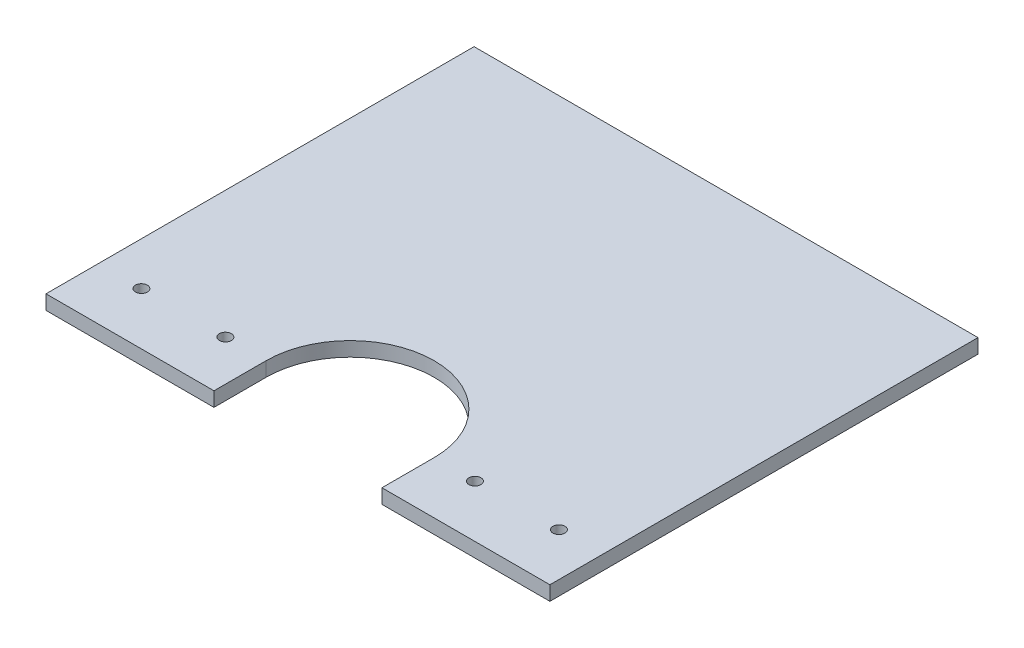
ISO-10303-21;
HEADER;
FILE_DESCRIPTION(('STEP AP214'),'2;1');
FILE_NAME('part.step','',(''),(''),'','','');
FILE_SCHEMA(('AUTOMOTIVE_DESIGN { 1 0 10303 214 1 1 1 1 }'));
ENDSEC;
DATA;
#1=APPLICATION_CONTEXT('core data for automotive mechanical design processes');
#2=APPLICATION_PROTOCOL_DEFINITION('international standard','automotive_design',2000,#1);
#3=PRODUCT_CONTEXT('',#1,'mechanical');
#4=PRODUCT('Part','Part','',(#3));
#5=PRODUCT_RELATED_PRODUCT_CATEGORY('part','',(#4));
#6=PRODUCT_DEFINITION_FORMATION('','',#4);
#7=PRODUCT_DEFINITION_CONTEXT('part definition',#1,'design');
#8=PRODUCT_DEFINITION('design','',#6,#7);
#9=PRODUCT_DEFINITION_SHAPE('','',#8);
#10=(LENGTH_UNIT() NAMED_UNIT(*) SI_UNIT(.MILLI.,.METRE.));
#11=(NAMED_UNIT(*) PLANE_ANGLE_UNIT() SI_UNIT($,.RADIAN.));
#12=(NAMED_UNIT(*) SI_UNIT($,.STERADIAN.) SOLID_ANGLE_UNIT());
#13=UNCERTAINTY_MEASURE_WITH_UNIT(LENGTH_MEASURE(1.E-05),#10,'distance_accuracy_value','');
#14=(GEOMETRIC_REPRESENTATION_CONTEXT(3) GLOBAL_UNCERTAINTY_ASSIGNED_CONTEXT((#13)) GLOBAL_UNIT_ASSIGNED_CONTEXT((#10,
#11,#12)) REPRESENTATION_CONTEXT('',''));
#15=CARTESIAN_POINT('',(0.,0.,0.));
#16=DIRECTION('',(0.,0.,1.));
#17=DIRECTION('',(1.,0.,0.));
#18=AXIS2_PLACEMENT_3D('',#15,#16,#17);
#19=CARTESIAN_POINT('',(0.0028313264358502,3.,67.4435466225317));
#20=DIRECTION('',(0.,1.,0.));
#21=DIRECTION('',(0.,0.,1.));
#22=AXIS2_PLACEMENT_3D('',#19,#20,#21);
#23=PLANE('',#22);
#24=CARTESIAN_POINT('',(-86.9998058042745,3.,67.4435466225317));
#25=DIRECTION('',(0.,1.,0.));
#26=DIRECTION('',(0.,0.,1.));
#27=AXIS2_PLACEMENT_3D('',#24,#25,#26);
#28=CIRCLE('',#27,2.5);
#29=CARTESIAN_POINT('',(-86.9998058042745,3.,69.9435466225317));
#30=VERTEX_POINT('',#29);
#31=EDGE_CURVE('E188',#30,#30,#28,.T.);
#32=ORIENTED_EDGE('',*,*,#31,.F.);
#33=EDGE_LOOP('',(#32));
#34=FACE_BOUND('',#33,.T.);
#35=CARTESIAN_POINT('',(52.0001941957256,3.,67.4435466225317));
#36=DIRECTION('',(0.,1.,0.));
#37=DIRECTION('',(0.,0.,1.));
#38=AXIS2_PLACEMENT_3D('',#35,#36,#37);
#39=CIRCLE('',#38,2.5);
#40=CARTESIAN_POINT('',(52.0001941957256,3.,69.9435466225317));
#41=VERTEX_POINT('',#40);
#42=EDGE_CURVE('E134',#41,#41,#39,.T.);
#43=ORIENTED_EDGE('',*,*,#42,.F.);
#44=EDGE_LOOP('',(#43));
#45=FACE_BOUND('',#44,.T.);
#46=DIRECTION('',(5.08073783313934E-06,0.,0.999999999987093));
#47=VECTOR('',#46,1.);
#48=CARTESIAN_POINT('',(-104.999287788481,3.,89.2003533774611));
#49=LINE('',#48,#47);
#50=CARTESIAN_POINT('',(-105.000194195701,3.,-89.2003533774627));
#51=VERTEX_POINT('',#50);
#52=CARTESIAN_POINT('',(-104.999287788481,3.,89.2003533774611));
#53=VERTEX_POINT('',#52);
#54=EDGE_CURVE('E145',#51,#53,#49,.T.);
#55=ORIENTED_EDGE('',*,*,#54,.T.);
#56=DIRECTION('',(1.,0.,0.));
#57=VECTOR('',#56,1.);
#58=CARTESIAN_POINT('',(-34.9998058042744,3.,89.200353377461));
#59=LINE('',#58,#57);
#60=CARTESIAN_POINT('',(-34.9998058042744,3.,89.200353377461));
#61=VERTEX_POINT('',#60);
#62=EDGE_CURVE('E93',#53,#61,#59,.T.);
#63=ORIENTED_EDGE('',*,*,#62,.T.);
#64=DIRECTION('',(0.000121209455074105,0.,-0.999999992654134));
#65=VECTOR('',#64,1.);
#66=CARTESIAN_POINT('',(-34.9971686735642,3.,67.4435466225317));
#67=LINE('',#66,#65);
#68=CARTESIAN_POINT('',(-34.9971686735642,3.,67.4435466225317));
#69=VERTEX_POINT('',#68);
#70=EDGE_CURVE('E160',#61,#69,#67,.T.);
#71=ORIENTED_EDGE('',*,*,#70,.T.);
#72=CARTESIAN_POINT('',(0.0028313264358502,3.,67.4435466225317));
#73=DIRECTION('',(0.,-1.,0.));
#74=DIRECTION('',(0.,0.,1.));
#75=AXIS2_PLACEMENT_3D('',#72,#73,#74);
#76=CIRCLE('',#75,35.);
#77=CARTESIAN_POINT('',(35.0028313264359,3.,67.4435466225317));
#78=VERTEX_POINT('',#77);
#79=EDGE_CURVE('E173',#69,#78,#76,.T.);
#80=ORIENTED_EDGE('',*,*,#79,.T.);
#81=DIRECTION('',(-0.000121209455074715,0.,0.999999992654134));
#82=VECTOR('',#81,1.);
#83=CARTESIAN_POINT('',(35.0001941957256,3.,89.2003533774661));
#84=LINE('',#83,#82);
#85=CARTESIAN_POINT('',(35.0001941957256,3.,89.2003533774661));
#86=VERTEX_POINT('',#85);
#87=EDGE_CURVE('E112',#78,#86,#84,.T.);
#88=ORIENTED_EDGE('',*,*,#87,.T.);
#89=DIRECTION('',(1.,0.,0.));
#90=VECTOR('',#89,1.);
#91=CARTESIAN_POINT('',(104.999740994926,3.,89.2003533774669));
#92=LINE('',#91,#90);
#93=CARTESIAN_POINT('',(104.999740994926,3.,89.2003533774669));
#94=VERTEX_POINT('',#93);
#95=EDGE_CURVE('E106',#86,#94,#92,.T.);
#96=ORIENTED_EDGE('',*,*,#95,.T.);
#97=DIRECTION('',(0.,0.,-1.));
#98=VECTOR('',#97,1.);
#99=CARTESIAN_POINT('',(104.999740994926,3.,-89.2003533774643));
#100=LINE('',#99,#98);
#101=CARTESIAN_POINT('',(104.999740994926,3.,-89.2003533774643));
#102=VERTEX_POINT('',#101);
#103=EDGE_CURVE('E110',#94,#102,#100,.T.);
#104=ORIENTED_EDGE('',*,*,#103,.T.);
#105=DIRECTION('',(-1.,0.,0.));
#106=VECTOR('',#105,1.);
#107=CARTESIAN_POINT('',(-105.000194195701,3.,-89.2003533774627));
#108=LINE('',#107,#106);
#109=EDGE_CURVE('E50',#102,#51,#108,.T.);
#110=ORIENTED_EDGE('',*,*,#109,.T.);
#111=EDGE_LOOP('',(#55,#63,#71,#80,#88,#96,#104,#110));
#112=FACE_BOUND('',#111,.T.);
#113=CARTESIAN_POINT('',(-51.9998058042745,3.,67.4435466225315));
#114=DIRECTION('',(0.,1.,0.));
#115=DIRECTION('',(0.,0.,1.));
#116=AXIS2_PLACEMENT_3D('',#113,#114,#115);
#117=CIRCLE('',#116,2.49999999999995);
#118=CARTESIAN_POINT('',(-51.9998058042745,3.,69.9435466225315));
#119=VERTEX_POINT('',#118);
#120=EDGE_CURVE('E182',#119,#119,#117,.T.);
#121=ORIENTED_EDGE('',*,*,#120,.F.);
#122=EDGE_LOOP('',(#121));
#123=FACE_BOUND('',#122,.T.);
#124=CARTESIAN_POINT('',(87.0001941957256,3.,67.4435466225318));
#125=DIRECTION('',(0.,1.,0.));
#126=DIRECTION('',(0.,0.,1.));
#127=AXIS2_PLACEMENT_3D('',#124,#125,#126);
#128=CIRCLE('',#127,2.5);
#129=CARTESIAN_POINT('',(87.0001941957256,3.,69.9435466225318));
#130=VERTEX_POINT('',#129);
#131=EDGE_CURVE('E194',#130,#130,#128,.T.);
#132=ORIENTED_EDGE('',*,*,#131,.F.);
#133=EDGE_LOOP('',(#132));
#134=FACE_BOUND('',#133,.T.);
#135=ADVANCED_FACE('F33',(#34,#45,#112,#123,#134),#23,.T.);
#136=CARTESIAN_POINT('',(0.0028313264358502,-3.,67.4435466225317));
#137=DIRECTION('',(0.,1.,0.));
#138=DIRECTION('',(0.,0.,1.));
#139=AXIS2_PLACEMENT_3D('',#136,#137,#138);
#140=PLANE('',#139);
#141=CARTESIAN_POINT('',(-86.9998058042745,-3.,67.4435466225317));
#142=DIRECTION('',(0.,1.,0.));
#143=DIRECTION('',(0.,0.,1.));
#144=AXIS2_PLACEMENT_3D('',#141,#142,#143);
#145=CIRCLE('',#144,2.5);
#146=CARTESIAN_POINT('',(-86.9998058042745,-3.,69.9435466225317));
#147=VERTEX_POINT('',#146);
#148=EDGE_CURVE('E191',#147,#147,#145,.T.);
#149=ORIENTED_EDGE('',*,*,#148,.T.);
#150=EDGE_LOOP('',(#149));
#151=FACE_BOUND('',#150,.T.);
#152=CARTESIAN_POINT('',(52.0001941957256,-3.,67.4435466225317));
#153=DIRECTION('',(0.,1.,0.));
#154=DIRECTION('',(0.,0.,1.));
#155=AXIS2_PLACEMENT_3D('',#152,#153,#154);
#156=CIRCLE('',#155,2.5);
#157=CARTESIAN_POINT('',(52.0001941957256,-3.,69.9435466225317));
#158=VERTEX_POINT('',#157);
#159=EDGE_CURVE('E179',#158,#158,#156,.T.);
#160=ORIENTED_EDGE('',*,*,#159,.T.);
#161=EDGE_LOOP('',(#160));
#162=FACE_BOUND('',#161,.T.);
#163=DIRECTION('',(5.08073783313934E-06,0.,0.999999999987093));
#164=VECTOR('',#163,1.);
#165=CARTESIAN_POINT('',(-104.999287788481,-3.,89.2003533774611));
#166=LINE('',#165,#164);
#167=CARTESIAN_POINT('',(-105.000194195701,-3.,-89.2003533774627));
#168=VERTEX_POINT('',#167);
#169=CARTESIAN_POINT('',(-104.999287788481,-3.,89.2003533774611));
#170=VERTEX_POINT('',#169);
#171=EDGE_CURVE('E130',#168,#170,#166,.T.);
#172=ORIENTED_EDGE('',*,*,#171,.F.);
#173=DIRECTION('',(-1.,0.,0.));
#174=VECTOR('',#173,1.);
#175=CARTESIAN_POINT('',(-105.000194195701,-3.,-89.2003533774627));
#176=LINE('',#175,#174);
#177=CARTESIAN_POINT('',(104.999740994926,-3.,-89.2003533774643));
#178=VERTEX_POINT('',#177);
#179=EDGE_CURVE('E85',#178,#168,#176,.T.);
#180=ORIENTED_EDGE('',*,*,#179,.F.);
#181=DIRECTION('',(0.,0.,-1.));
#182=VECTOR('',#181,1.);
#183=CARTESIAN_POINT('',(104.999740994926,-3.,-89.2003533774643));
#184=LINE('',#183,#182);
#185=CARTESIAN_POINT('',(104.999740994926,-3.,89.2003533774669));
#186=VERTEX_POINT('',#185);
#187=EDGE_CURVE('E79',#186,#178,#184,.T.);
#188=ORIENTED_EDGE('',*,*,#187,.F.);
#189=DIRECTION('',(1.,0.,0.));
#190=VECTOR('',#189,1.);
#191=CARTESIAN_POINT('',(104.999740994926,-3.,89.2003533774669));
#192=LINE('',#191,#190);
#193=CARTESIAN_POINT('',(35.0001941957256,-3.,89.2003533774661));
#194=VERTEX_POINT('',#193);
#195=EDGE_CURVE('E120',#194,#186,#192,.T.);
#196=ORIENTED_EDGE('',*,*,#195,.F.);
#197=DIRECTION('',(-0.000121209455074715,0.,0.999999992654134));
#198=VECTOR('',#197,1.);
#199=CARTESIAN_POINT('',(35.0001941957256,-3.,89.2003533774661));
#200=LINE('',#199,#198);
#201=CARTESIAN_POINT('',(35.0028313264359,-3.,67.4435466225317));
#202=VERTEX_POINT('',#201);
#203=EDGE_CURVE('E140',#202,#194,#200,.T.);
#204=ORIENTED_EDGE('',*,*,#203,.F.);
#205=CARTESIAN_POINT('',(0.0028313264358502,-3.,67.4435466225317));
#206=DIRECTION('',(0.,-1.,0.));
#207=DIRECTION('',(0.,0.,1.));
#208=AXIS2_PLACEMENT_3D('',#205,#206,#207);
#209=CIRCLE('',#208,35.);
#210=CARTESIAN_POINT('',(-34.9971686735642,-3.,67.4435466225317));
#211=VERTEX_POINT('',#210);
#212=EDGE_CURVE('E138',#211,#202,#209,.T.);
#213=ORIENTED_EDGE('',*,*,#212,.F.);
#214=DIRECTION('',(0.000121209455074105,0.,-0.999999992654134));
#215=VECTOR('',#214,1.);
#216=CARTESIAN_POINT('',(-34.9971686735642,-3.,67.4435466225317));
#217=LINE('',#216,#215);
#218=CARTESIAN_POINT('',(-34.9998058042744,-3.,89.200353377461));
#219=VERTEX_POINT('',#218);
#220=EDGE_CURVE('E136',#219,#211,#217,.T.);
#221=ORIENTED_EDGE('',*,*,#220,.F.);
#222=DIRECTION('',(1.,0.,0.));
#223=VECTOR('',#222,1.);
#224=CARTESIAN_POINT('',(-34.9998058042744,-3.,89.200353377461));
#225=LINE('',#224,#223);
#226=EDGE_CURVE('E133',#170,#219,#225,.T.);
#227=ORIENTED_EDGE('',*,*,#226,.F.);
#228=EDGE_LOOP('',(#172,#180,#188,#196,#204,#213,#221,#227));
#229=FACE_BOUND('',#228,.T.);
#230=CARTESIAN_POINT('',(-51.9998058042745,-3.,67.4435466225315));
#231=DIRECTION('',(0.,1.,0.));
#232=DIRECTION('',(0.,0.,1.));
#233=AXIS2_PLACEMENT_3D('',#230,#231,#232);
#234=CIRCLE('',#233,2.49999999999995);
#235=CARTESIAN_POINT('',(-51.9998058042745,-3.,69.9435466225315));
#236=VERTEX_POINT('',#235);
#237=EDGE_CURVE('E185',#236,#236,#234,.T.);
#238=ORIENTED_EDGE('',*,*,#237,.T.);
#239=EDGE_LOOP('',(#238));
#240=FACE_BOUND('',#239,.T.);
#241=CARTESIAN_POINT('',(87.0001941957256,-3.,67.4435466225318));
#242=DIRECTION('',(0.,1.,0.));
#243=DIRECTION('',(0.,0.,1.));
#244=AXIS2_PLACEMENT_3D('',#241,#242,#243);
#245=CIRCLE('',#244,2.5);
#246=CARTESIAN_POINT('',(87.0001941957256,-3.,69.9435466225318));
#247=VERTEX_POINT('',#246);
#248=EDGE_CURVE('E197',#247,#247,#245,.T.);
#249=ORIENTED_EDGE('',*,*,#248,.T.);
#250=EDGE_LOOP('',(#249));
#251=FACE_BOUND('',#250,.T.);
#252=ADVANCED_FACE('F164',(#151,#162,#229,#240,#251),#140,.F.);
#253=CARTESIAN_POINT('',(-104.999287788481,3.,89.2003533774611));
#254=DIRECTION('',(0.999999999987093,0.,-5.08073783313934E-06));
#255=DIRECTION('',(-5.08073783313934E-06,0.,-0.999999999987093));
#256=AXIS2_PLACEMENT_3D('',#253,#254,#255);
#257=PLANE('',#256);
#258=ORIENTED_EDGE('',*,*,#171,.T.);
#259=DIRECTION('',(0.,-1.,0.));
#260=VECTOR('',#259,1.);
#261=CARTESIAN_POINT('',(-104.999287788481,3.,89.2003533774611));
#262=LINE('',#261,#260);
#263=EDGE_CURVE('E11',#53,#170,#262,.T.);
#264=ORIENTED_EDGE('',*,*,#263,.F.);
#265=ORIENTED_EDGE('',*,*,#54,.F.);
#266=DIRECTION('',(0.,-1.,0.));
#267=VECTOR('',#266,1.);
#268=CARTESIAN_POINT('',(-105.000194195701,3.,-89.2003533774627));
#269=LINE('',#268,#267);
#270=EDGE_CURVE('E126',#51,#168,#269,.T.);
#271=ORIENTED_EDGE('',*,*,#270,.T.);
#272=EDGE_LOOP('',(#258,#264,#265,#271));
#273=FACE_BOUND('',#272,.T.);
#274=ADVANCED_FACE('F35',(#273),#257,.F.);
#275=CARTESIAN_POINT('',(-34.9998058042744,3.,89.200353377461));
#276=DIRECTION('',(0.,0.,-1.));
#277=DIRECTION('',(-1.,0.,0.));
#278=AXIS2_PLACEMENT_3D('',#275,#276,#277);
#279=PLANE('',#278);
#280=ORIENTED_EDGE('',*,*,#226,.T.);
#281=DIRECTION('',(0.,-1.,0.));
#282=VECTOR('',#281,1.);
#283=CARTESIAN_POINT('',(-34.9998058042744,3.,89.200353377461));
#284=LINE('',#283,#282);
#285=EDGE_CURVE('E42',#61,#219,#284,.T.);
#286=ORIENTED_EDGE('',*,*,#285,.F.);
#287=ORIENTED_EDGE('',*,*,#62,.F.);
#288=ORIENTED_EDGE('',*,*,#263,.T.);
#289=EDGE_LOOP('',(#280,#286,#287,#288));
#290=FACE_BOUND('',#289,.T.);
#291=ADVANCED_FACE('F232',(#290),#279,.F.);
#292=CARTESIAN_POINT('',(-34.9971686735642,3.,67.4435466225317));
#293=DIRECTION('',(-0.999999992654134,0.,-0.000121209455074105));
#294=DIRECTION('',(-0.000121209455074105,0.,0.999999992654134));
#295=AXIS2_PLACEMENT_3D('',#292,#293,#294);
#296=PLANE('',#295);
#297=ORIENTED_EDGE('',*,*,#220,.T.);
#298=DIRECTION('',(0.,-1.,0.));
#299=VECTOR('',#298,1.);
#300=CARTESIAN_POINT('',(-34.9971686735642,3.,67.4435466225317));
#301=LINE('',#300,#299);
#302=EDGE_CURVE('E152',#69,#211,#301,.T.);
#303=ORIENTED_EDGE('',*,*,#302,.F.);
#304=ORIENTED_EDGE('',*,*,#70,.F.);
#305=ORIENTED_EDGE('',*,*,#285,.T.);
#306=EDGE_LOOP('',(#297,#303,#304,#305));
#307=FACE_BOUND('',#306,.T.);
#308=ADVANCED_FACE('F158',(#307),#296,.F.);
#309=CARTESIAN_POINT('',(0.0028313264358502,3.,67.4435466225317));
#310=DIRECTION('',(0.,-1.,0.));
#311=DIRECTION('',(0.,0.,-1.));
#312=AXIS2_PLACEMENT_3D('',#309,#310,#311);
#313=CYLINDRICAL_SURFACE('',#312,35.);
#314=ORIENTED_EDGE('',*,*,#212,.T.);
#315=DIRECTION('',(0.,-1.,0.));
#316=VECTOR('',#315,1.);
#317=CARTESIAN_POINT('',(35.0028313264359,3.,67.4435466225317));
#318=LINE('',#317,#316);
#319=EDGE_CURVE('E149',#78,#202,#318,.T.);
#320=ORIENTED_EDGE('',*,*,#319,.F.);
#321=ORIENTED_EDGE('',*,*,#79,.F.);
#322=ORIENTED_EDGE('',*,*,#302,.T.);
#323=EDGE_LOOP('',(#314,#320,#321,#322));
#324=FACE_BOUND('',#323,.T.);
#325=ADVANCED_FACE('F169',(#324),#313,.F.);
#326=CARTESIAN_POINT('',(35.0001941957256,3.,89.2003533774661));
#327=DIRECTION('',(0.999999992654134,0.,0.000121209455074715));
#328=DIRECTION('',(0.000121209455074715,0.,-0.999999992654134));
#329=AXIS2_PLACEMENT_3D('',#326,#327,#328);
#330=PLANE('',#329);
#331=ORIENTED_EDGE('',*,*,#203,.T.);
#332=DIRECTION('',(0.,-1.,0.));
#333=VECTOR('',#332,1.);
#334=CARTESIAN_POINT('',(35.0001941957256,3.,89.2003533774661));
#335=LINE('',#334,#333);
#336=EDGE_CURVE('E121',#86,#194,#335,.T.);
#337=ORIENTED_EDGE('',*,*,#336,.F.);
#338=ORIENTED_EDGE('',*,*,#87,.F.);
#339=ORIENTED_EDGE('',*,*,#319,.T.);
#340=EDGE_LOOP('',(#331,#337,#338,#339));
#341=FACE_BOUND('',#340,.T.);
#342=ADVANCED_FACE('F172',(#341),#330,.F.);
#343=CARTESIAN_POINT('',(104.999740994926,3.,89.2003533774669));
#344=DIRECTION('',(0.,0.,-1.));
#345=DIRECTION('',(-1.,0.,0.));
#346=AXIS2_PLACEMENT_3D('',#343,#344,#345);
#347=PLANE('',#346);
#348=ORIENTED_EDGE('',*,*,#195,.T.);
#349=DIRECTION('',(0.,-1.,0.));
#350=VECTOR('',#349,1.);
#351=CARTESIAN_POINT('',(104.999740994926,3.,89.2003533774669));
#352=LINE('',#351,#350);
#353=EDGE_CURVE('E117',#94,#186,#352,.T.);
#354=ORIENTED_EDGE('',*,*,#353,.F.);
#355=ORIENTED_EDGE('',*,*,#95,.F.);
#356=ORIENTED_EDGE('',*,*,#336,.T.);
#357=EDGE_LOOP('',(#348,#354,#355,#356));
#358=FACE_BOUND('',#357,.T.);
#359=ADVANCED_FACE('F118',(#358),#347,.F.);
#360=CARTESIAN_POINT('',(104.999740994926,3.,-89.2003533774643));
#361=DIRECTION('',(-1.,0.,0.));
#362=DIRECTION('',(0.,0.,1.));
#363=AXIS2_PLACEMENT_3D('',#360,#361,#362);
#364=PLANE('',#363);
#365=ORIENTED_EDGE('',*,*,#187,.T.);
#366=DIRECTION('',(0.,-1.,0.));
#367=VECTOR('',#366,1.);
#368=CARTESIAN_POINT('',(104.999740994926,3.,-89.2003533774643));
#369=LINE('',#368,#367);
#370=EDGE_CURVE('E122',#102,#178,#369,.T.);
#371=ORIENTED_EDGE('',*,*,#370,.F.);
#372=ORIENTED_EDGE('',*,*,#103,.F.);
#373=ORIENTED_EDGE('',*,*,#353,.T.);
#374=EDGE_LOOP('',(#365,#371,#372,#373));
#375=FACE_BOUND('',#374,.T.);
#376=ADVANCED_FACE('F124',(#375),#364,.F.);
#377=CARTESIAN_POINT('',(-105.000194195701,3.,-89.2003533774627));
#378=DIRECTION('',(0.,0.,1.));
#379=DIRECTION('',(1.,0.,0.));
#380=AXIS2_PLACEMENT_3D('',#377,#378,#379);
#381=PLANE('',#380);
#382=ORIENTED_EDGE('',*,*,#179,.T.);
#383=ORIENTED_EDGE('',*,*,#270,.F.);
#384=ORIENTED_EDGE('',*,*,#109,.F.);
#385=ORIENTED_EDGE('',*,*,#370,.T.);
#386=EDGE_LOOP('',(#382,#383,#384,#385));
#387=FACE_BOUND('',#386,.T.);
#388=ADVANCED_FACE('F220',(#387),#381,.F.);
#389=CARTESIAN_POINT('',(52.0001941957256,3.,67.4435466225317));
#390=DIRECTION('',(0.,-1.,0.));
#391=DIRECTION('',(0.,0.,-1.));
#392=AXIS2_PLACEMENT_3D('',#389,#390,#391);
#393=CYLINDRICAL_SURFACE('',#392,2.5);
#394=ORIENTED_EDGE('',*,*,#42,.T.);
#395=EDGE_LOOP('',(#394));
#396=FACE_BOUND('',#395,.T.);
#397=ORIENTED_EDGE('',*,*,#159,.F.);
#398=EDGE_LOOP('',(#397));
#399=FACE_BOUND('',#398,.T.);
#400=ADVANCED_FACE('F217',(#396,#399),#393,.F.);
#401=CARTESIAN_POINT('',(-51.9998058042745,3.,67.4435466225315));
#402=DIRECTION('',(0.,-1.,0.));
#403=DIRECTION('',(0.,0.,-1.));
#404=AXIS2_PLACEMENT_3D('',#401,#402,#403);
#405=CYLINDRICAL_SURFACE('',#404,2.49999999999995);
#406=ORIENTED_EDGE('',*,*,#120,.T.);
#407=EDGE_LOOP('',(#406));
#408=FACE_BOUND('',#407,.T.);
#409=ORIENTED_EDGE('',*,*,#237,.F.);
#410=EDGE_LOOP('',(#409));
#411=FACE_BOUND('',#410,.T.);
#412=ADVANCED_FACE('F296',(#408,#411),#405,.F.);
#413=CARTESIAN_POINT('',(-86.9998058042745,3.,67.4435466225317));
#414=DIRECTION('',(0.,-1.,0.));
#415=DIRECTION('',(0.,0.,-1.));
#416=AXIS2_PLACEMENT_3D('',#413,#414,#415);
#417=CYLINDRICAL_SURFACE('',#416,2.5);
#418=ORIENTED_EDGE('',*,*,#31,.T.);
#419=EDGE_LOOP('',(#418));
#420=FACE_BOUND('',#419,.T.);
#421=ORIENTED_EDGE('',*,*,#148,.F.);
#422=EDGE_LOOP('',(#421));
#423=FACE_BOUND('',#422,.T.);
#424=ADVANCED_FACE('F304',(#420,#423),#417,.F.);
#425=CARTESIAN_POINT('',(87.0001941957256,3.,67.4435466225318));
#426=DIRECTION('',(0.,-1.,0.));
#427=DIRECTION('',(0.,0.,-1.));
#428=AXIS2_PLACEMENT_3D('',#425,#426,#427);
#429=CYLINDRICAL_SURFACE('',#428,2.5);
#430=ORIENTED_EDGE('',*,*,#131,.T.);
#431=EDGE_LOOP('',(#430));
#432=FACE_BOUND('',#431,.T.);
#433=ORIENTED_EDGE('',*,*,#248,.F.);
#434=EDGE_LOOP('',(#433));
#435=FACE_BOUND('',#434,.T.);
#436=ADVANCED_FACE('F203',(#432,#435),#429,.F.);
#437=CLOSED_SHELL('',(#135,#252,#274,#291,#308,#325,#342,#359,#376,#388,#400,#412,#424,#436));
#438=MANIFOLD_SOLID_BREP('B2',#437);
#439=ADVANCED_BREP_SHAPE_REPRESENTATION('',(#18,#438),#14);
#440=SHAPE_DEFINITION_REPRESENTATION(#9,#439);
ENDSEC;
END-ISO-10303-21;
